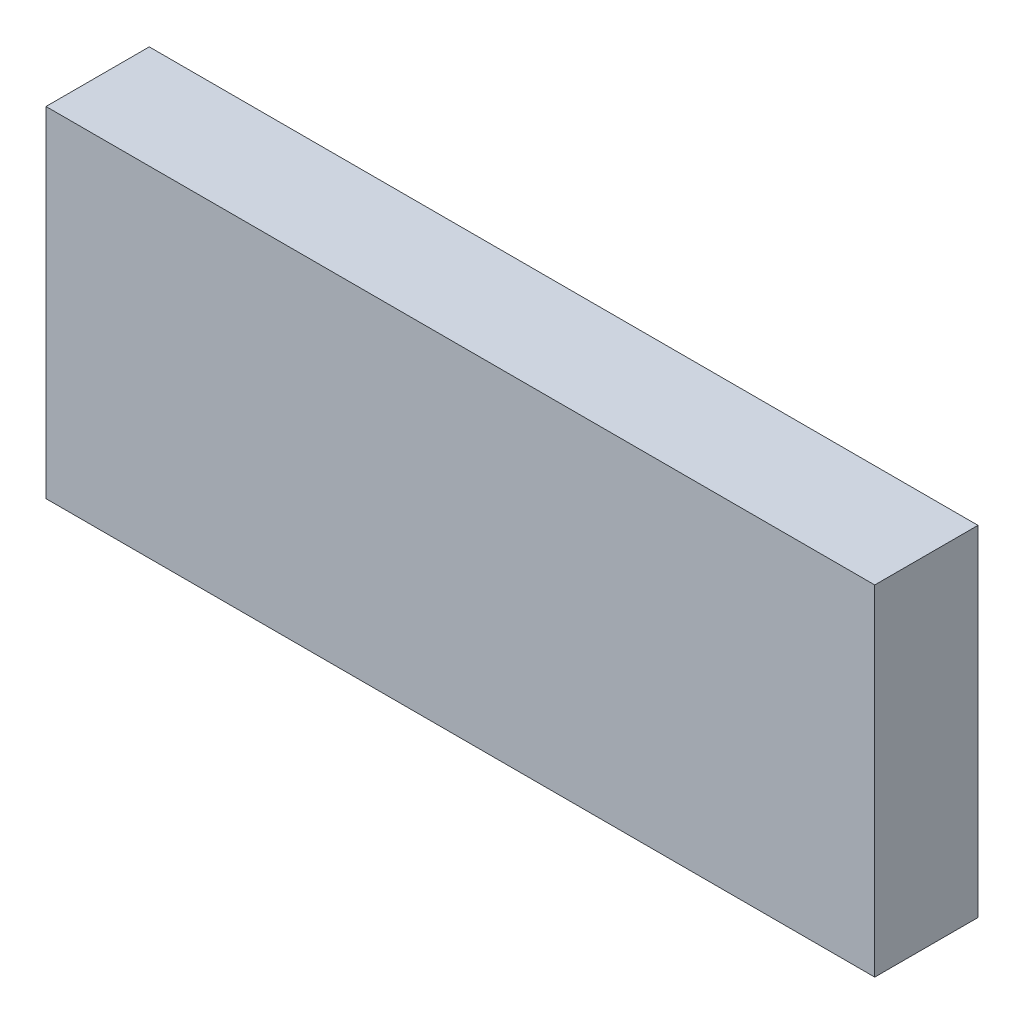
ISO-10303-21;
HEADER;
FILE_DESCRIPTION(('STEP AP214'),'2;1');
FILE_NAME('part.step','',(''),(''),'','','');
FILE_SCHEMA(('AUTOMOTIVE_DESIGN { 1 0 10303 214 1 1 1 1 }'));
ENDSEC;
DATA;
#1=APPLICATION_CONTEXT('core data for automotive mechanical design processes');
#2=APPLICATION_PROTOCOL_DEFINITION('international standard','automotive_design',2000,#1);
#3=PRODUCT_CONTEXT('',#1,'mechanical');
#4=PRODUCT('Part','Part','',(#3));
#5=PRODUCT_RELATED_PRODUCT_CATEGORY('part','',(#4));
#6=PRODUCT_DEFINITION_FORMATION('','',#4);
#7=PRODUCT_DEFINITION_CONTEXT('part definition',#1,'design');
#8=PRODUCT_DEFINITION('design','',#6,#7);
#9=PRODUCT_DEFINITION_SHAPE('','',#8);
#10=(LENGTH_UNIT() NAMED_UNIT(*) SI_UNIT(.MILLI.,.METRE.));
#11=(NAMED_UNIT(*) PLANE_ANGLE_UNIT() SI_UNIT($,.RADIAN.));
#12=(NAMED_UNIT(*) SI_UNIT($,.STERADIAN.) SOLID_ANGLE_UNIT());
#13=UNCERTAINTY_MEASURE_WITH_UNIT(LENGTH_MEASURE(1.E-05),#10,'distance_accuracy_value','');
#14=(GEOMETRIC_REPRESENTATION_CONTEXT(3) GLOBAL_UNCERTAINTY_ASSIGNED_CONTEXT((#13)) GLOBAL_UNIT_ASSIGNED_CONTEXT((#10,
#11,#12)) REPRESENTATION_CONTEXT('',''));
#15=CARTESIAN_POINT('',(0.,0.,0.));
#16=DIRECTION('',(0.,0.,1.));
#17=DIRECTION('',(1.,0.,0.));
#18=AXIS2_PLACEMENT_3D('',#15,#16,#17);
#19=CARTESIAN_POINT('',(1.52500076,-0.62500002,0.37999924));
#20=DIRECTION('',(0.,0.,1.));
#21=DIRECTION('',(1.,0.,0.));
#22=AXIS2_PLACEMENT_3D('',#19,#20,#21);
#23=PLANE('',#22);
#24=DIRECTION('',(0.,-1.,0.));
#25=VECTOR('',#24,1.);
#26=CARTESIAN_POINT('',(1.52500076,0.62500002,0.37999924));
#27=LINE('',#26,#25);
#28=CARTESIAN_POINT('',(1.52500076,0.62500002,0.37999924));
#29=VERTEX_POINT('',#28);
#30=CARTESIAN_POINT('',(1.52500076,-0.62500002,0.37999924));
#31=VERTEX_POINT('',#30);
#32=EDGE_CURVE('E28',#29,#31,#27,.T.);
#33=ORIENTED_EDGE('',*,*,#32,.F.);
#34=DIRECTION('',(1.,0.,0.));
#35=VECTOR('',#34,1.);
#36=CARTESIAN_POINT('',(-1.52499822,0.62500002,0.37999924));
#37=LINE('',#36,#35);
#38=CARTESIAN_POINT('',(-1.52499822,0.62500002,0.37999924));
#39=VERTEX_POINT('',#38);
#40=EDGE_CURVE('E21',#39,#29,#37,.T.);
#41=ORIENTED_EDGE('',*,*,#40,.F.);
#42=DIRECTION('',(0.,1.,0.));
#43=VECTOR('',#42,1.);
#44=CARTESIAN_POINT('',(-1.52499822,-0.62500002,0.37999924));
#45=LINE('',#44,#43);
#46=CARTESIAN_POINT('',(-1.52499822,-0.62500002,0.37999924));
#47=VERTEX_POINT('',#46);
#48=EDGE_CURVE('E76',#47,#39,#45,.T.);
#49=ORIENTED_EDGE('',*,*,#48,.F.);
#50=DIRECTION('',(-1.,0.,0.));
#51=VECTOR('',#50,1.);
#52=CARTESIAN_POINT('',(1.52500076,-0.62500002,0.37999924));
#53=LINE('',#52,#51);
#54=EDGE_CURVE('E104',#31,#47,#53,.T.);
#55=ORIENTED_EDGE('',*,*,#54,.F.);
#56=EDGE_LOOP('',(#33,#41,#49,#55));
#57=FACE_BOUND('',#56,.T.);
#58=ADVANCED_FACE('F17',(#57),#23,.T.);
#59=CARTESIAN_POINT('',(1.52500076,-0.62500002,0.));
#60=DIRECTION('',(0.,0.,1.));
#61=DIRECTION('',(1.,0.,0.));
#62=AXIS2_PLACEMENT_3D('',#59,#60,#61);
#63=PLANE('',#62);
#64=DIRECTION('',(-1.,0.,0.));
#65=VECTOR('',#64,1.);
#66=CARTESIAN_POINT('',(1.52500076,-0.62500002,0.));
#67=LINE('',#66,#65);
#68=CARTESIAN_POINT('',(1.52500076,-0.62500002,0.));
#69=VERTEX_POINT('',#68);
#70=CARTESIAN_POINT('',(-1.52499822,-0.62500002,0.));
#71=VERTEX_POINT('',#70);
#72=EDGE_CURVE('E92',#69,#71,#67,.T.);
#73=ORIENTED_EDGE('',*,*,#72,.T.);
#74=DIRECTION('',(0.,1.,0.));
#75=VECTOR('',#74,1.);
#76=CARTESIAN_POINT('',(-1.52499822,-0.62500002,0.));
#77=LINE('',#76,#75);
#78=CARTESIAN_POINT('',(-1.52499822,0.62500002,0.));
#79=VERTEX_POINT('',#78);
#80=EDGE_CURVE('E80',#71,#79,#77,.T.);
#81=ORIENTED_EDGE('',*,*,#80,.T.);
#82=DIRECTION('',(1.,0.,0.));
#83=VECTOR('',#82,1.);
#84=CARTESIAN_POINT('',(-1.52499822,0.62500002,0.));
#85=LINE('',#84,#83);
#86=CARTESIAN_POINT('',(1.52500076,0.62500002,0.));
#87=VERTEX_POINT('',#86);
#88=EDGE_CURVE('E67',#79,#87,#85,.T.);
#89=ORIENTED_EDGE('',*,*,#88,.T.);
#90=DIRECTION('',(0.,-1.,0.));
#91=VECTOR('',#90,1.);
#92=CARTESIAN_POINT('',(1.52500076,0.62500002,0.));
#93=LINE('',#92,#91);
#94=EDGE_CURVE('E11',#87,#69,#93,.T.);
#95=ORIENTED_EDGE('',*,*,#94,.T.);
#96=EDGE_LOOP('',(#73,#81,#89,#95));
#97=FACE_BOUND('',#96,.T.);
#98=ADVANCED_FACE('F122',(#97),#63,.F.);
#99=CARTESIAN_POINT('',(1.52500076,0.62500002,0.));
#100=DIRECTION('',(1.,0.,0.));
#101=DIRECTION('',(0.,1.,0.));
#102=AXIS2_PLACEMENT_3D('',#99,#100,#101);
#103=PLANE('',#102);
#104=DIRECTION('',(0.,0.,1.));
#105=VECTOR('',#104,1.);
#106=CARTESIAN_POINT('',(1.52500076,0.62500002,0.));
#107=LINE('',#106,#105);
#108=EDGE_CURVE('E79',#87,#29,#107,.T.);
#109=ORIENTED_EDGE('',*,*,#108,.T.);
#110=ORIENTED_EDGE('',*,*,#32,.T.);
#111=DIRECTION('',(0.,0.,1.));
#112=VECTOR('',#111,1.);
#113=CARTESIAN_POINT('',(1.52500076,-0.62500002,0.));
#114=LINE('',#113,#112);
#115=EDGE_CURVE('E112',#69,#31,#114,.T.);
#116=ORIENTED_EDGE('',*,*,#115,.F.);
#117=ORIENTED_EDGE('',*,*,#94,.F.);
#118=EDGE_LOOP('',(#109,#110,#116,#117));
#119=FACE_BOUND('',#118,.T.);
#120=ADVANCED_FACE('F120',(#119),#103,.T.);
#121=CARTESIAN_POINT('',(-1.52499822,0.62500002,0.));
#122=DIRECTION('',(0.,1.,0.));
#123=DIRECTION('',(1.,0.,0.));
#124=AXIS2_PLACEMENT_3D('',#121,#122,#123);
#125=PLANE('',#124);
#126=DIRECTION('',(0.,0.,1.));
#127=VECTOR('',#126,1.);
#128=CARTESIAN_POINT('',(-1.52499822,0.62500002,0.));
#129=LINE('',#128,#127);
#130=EDGE_CURVE('E82',#79,#39,#129,.T.);
#131=ORIENTED_EDGE('',*,*,#130,.T.);
#132=ORIENTED_EDGE('',*,*,#40,.T.);
#133=ORIENTED_EDGE('',*,*,#108,.F.);
#134=ORIENTED_EDGE('',*,*,#88,.F.);
#135=EDGE_LOOP('',(#131,#132,#133,#134));
#136=FACE_BOUND('',#135,.T.);
#137=ADVANCED_FACE('F83',(#136),#125,.T.);
#138=CARTESIAN_POINT('',(-1.52499822,-0.62500002,0.));
#139=DIRECTION('',(-1.,0.,0.));
#140=DIRECTION('',(0.,0.,1.));
#141=AXIS2_PLACEMENT_3D('',#138,#139,#140);
#142=PLANE('',#141);
#143=DIRECTION('',(0.,0.,1.));
#144=VECTOR('',#143,1.);
#145=CARTESIAN_POINT('',(-1.52499822,-0.62500002,0.));
#146=LINE('',#145,#144);
#147=EDGE_CURVE('E89',#71,#47,#146,.T.);
#148=ORIENTED_EDGE('',*,*,#147,.T.);
#149=ORIENTED_EDGE('',*,*,#48,.T.);
#150=ORIENTED_EDGE('',*,*,#130,.F.);
#151=ORIENTED_EDGE('',*,*,#80,.F.);
#152=EDGE_LOOP('',(#148,#149,#150,#151));
#153=FACE_BOUND('',#152,.T.);
#154=ADVANCED_FACE('F87',(#153),#142,.T.);
#155=CARTESIAN_POINT('',(1.52500076,-0.62500002,0.));
#156=DIRECTION('',(0.,-1.,0.));
#157=DIRECTION('',(0.,0.,-1.));
#158=AXIS2_PLACEMENT_3D('',#155,#156,#157);
#159=PLANE('',#158);
#160=ORIENTED_EDGE('',*,*,#115,.T.);
#161=ORIENTED_EDGE('',*,*,#54,.T.);
#162=ORIENTED_EDGE('',*,*,#147,.F.);
#163=ORIENTED_EDGE('',*,*,#72,.F.);
#164=EDGE_LOOP('',(#160,#161,#162,#163));
#165=FACE_BOUND('',#164,.T.);
#166=ADVANCED_FACE('F19',(#165),#159,.T.);
#167=CLOSED_SHELL('',(#58,#98,#120,#137,#154,#166));
#168=MANIFOLD_SOLID_BREP('B1',#167);
#169=ADVANCED_BREP_SHAPE_REPRESENTATION('',(#18,#168),#14);
#170=SHAPE_DEFINITION_REPRESENTATION(#9,#169);
ENDSEC;
END-ISO-10303-21;
